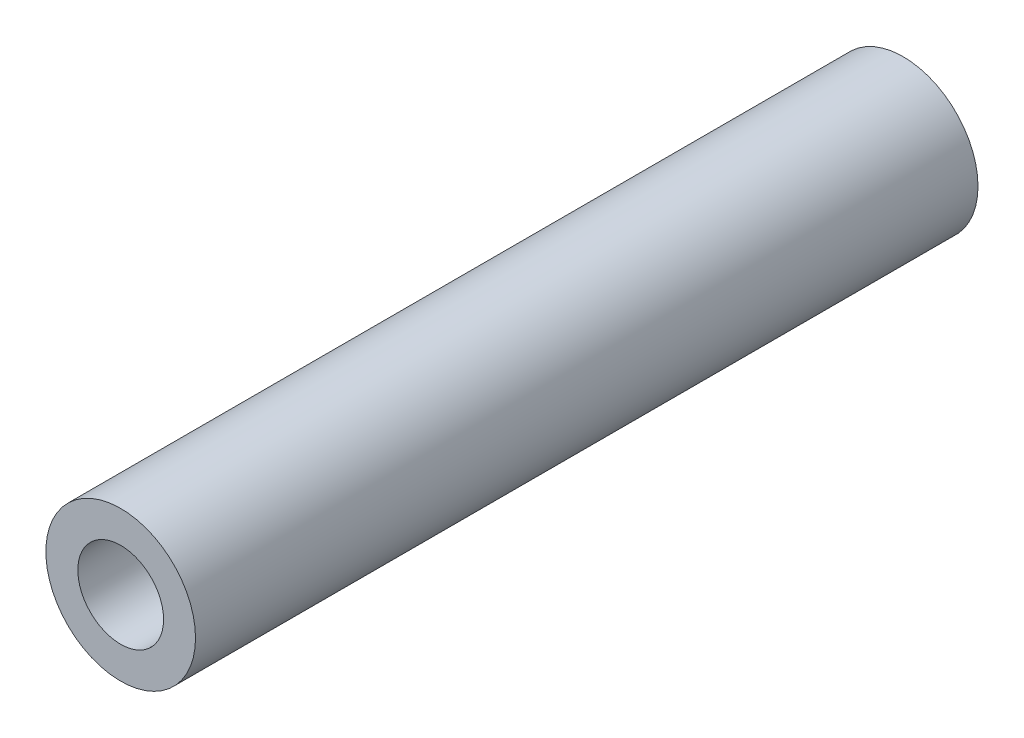
ISO-10303-21;
HEADER;
FILE_DESCRIPTION(('STEP AP214'),'2;1');
FILE_NAME('part.step','',(''),(''),'','','');
FILE_SCHEMA(('AUTOMOTIVE_DESIGN { 1 0 10303 214 1 1 1 1 }'));
ENDSEC;
DATA;
#1=APPLICATION_CONTEXT('core data for automotive mechanical design processes');
#2=APPLICATION_PROTOCOL_DEFINITION('international standard','automotive_design',2000,#1);
#3=PRODUCT_CONTEXT('',#1,'mechanical');
#4=PRODUCT('Part','Part','',(#3));
#5=PRODUCT_RELATED_PRODUCT_CATEGORY('part','',(#4));
#6=PRODUCT_DEFINITION_FORMATION('','',#4);
#7=PRODUCT_DEFINITION_CONTEXT('part definition',#1,'design');
#8=PRODUCT_DEFINITION('design','',#6,#7);
#9=PRODUCT_DEFINITION_SHAPE('','',#8);
#10=(LENGTH_UNIT() NAMED_UNIT(*) SI_UNIT(.MILLI.,.METRE.));
#11=(NAMED_UNIT(*) PLANE_ANGLE_UNIT() SI_UNIT($,.RADIAN.));
#12=(NAMED_UNIT(*) SI_UNIT($,.STERADIAN.) SOLID_ANGLE_UNIT());
#13=UNCERTAINTY_MEASURE_WITH_UNIT(LENGTH_MEASURE(1.E-05),#10,'distance_accuracy_value','');
#14=(GEOMETRIC_REPRESENTATION_CONTEXT(3) GLOBAL_UNCERTAINTY_ASSIGNED_CONTEXT((#13)) GLOBAL_UNIT_ASSIGNED_CONTEXT((#10,
#11,#12)) REPRESENTATION_CONTEXT('',''));
#15=CARTESIAN_POINT('',(0.,0.,0.));
#16=DIRECTION('',(0.,0.,1.));
#17=DIRECTION('',(1.,0.,0.));
#18=AXIS2_PLACEMENT_3D('',#15,#16,#17);
#19=CARTESIAN_POINT('',(0.,0.,25.49906));
#20=DIRECTION('',(0.,0.,1.));
#21=DIRECTION('',(1.,0.,0.));
#22=AXIS2_PLACEMENT_3D('',#19,#20,#21);
#23=PLANE('',#22);
#24=CARTESIAN_POINT('',(0.,0.,25.49906));
#25=DIRECTION('',(0.,0.,1.));
#26=DIRECTION('',(1.,0.,0.));
#27=AXIS2_PLACEMENT_3D('',#24,#25,#26);
#28=CIRCLE('',#27,2.4384);
#29=CARTESIAN_POINT('',(2.4384,0.,25.49906));
#30=VERTEX_POINT('',#29);
#31=EDGE_CURVE('E10',#30,#30,#28,.T.);
#32=ORIENTED_EDGE('',*,*,#31,.T.);
#33=EDGE_LOOP('',(#32));
#34=FACE_BOUND('',#33,.T.);
#35=CARTESIAN_POINT('',(0.,0.,25.49906));
#36=DIRECTION('',(0.,0.,1.));
#37=DIRECTION('',(1.,0.,0.));
#38=AXIS2_PLACEMENT_3D('',#35,#36,#37);
#39=CIRCLE('',#38,1.397);
#40=CARTESIAN_POINT('',(1.397,0.,25.49906));
#41=VERTEX_POINT('',#40);
#42=EDGE_CURVE('E44',#41,#41,#39,.T.);
#43=ORIENTED_EDGE('',*,*,#42,.F.);
#44=EDGE_LOOP('',(#43));
#45=FACE_BOUND('',#44,.T.);
#46=ADVANCED_FACE('F33',(#34,#45),#23,.T.);
#47=CARTESIAN_POINT('',(0.,0.,0.));
#48=DIRECTION('',(0.,0.,1.));
#49=DIRECTION('',(1.,0.,0.));
#50=AXIS2_PLACEMENT_3D('',#47,#48,#49);
#51=PLANE('',#50);
#52=CARTESIAN_POINT('',(0.,0.,0.));
#53=DIRECTION('',(0.,0.,1.));
#54=DIRECTION('',(1.,0.,0.));
#55=AXIS2_PLACEMENT_3D('',#52,#53,#54);
#56=CIRCLE('',#55,2.4384);
#57=CARTESIAN_POINT('',(2.4384,0.,0.));
#58=VERTEX_POINT('',#57);
#59=EDGE_CURVE('E37',#58,#58,#56,.T.);
#60=ORIENTED_EDGE('',*,*,#59,.F.);
#61=EDGE_LOOP('',(#60));
#62=FACE_BOUND('',#61,.T.);
#63=CARTESIAN_POINT('',(0.,0.,0.));
#64=DIRECTION('',(0.,0.,1.));
#65=DIRECTION('',(1.,0.,0.));
#66=AXIS2_PLACEMENT_3D('',#63,#64,#65);
#67=CIRCLE('',#66,1.397);
#68=CARTESIAN_POINT('',(1.397,0.,0.));
#69=VERTEX_POINT('',#68);
#70=EDGE_CURVE('E46',#69,#69,#67,.T.);
#71=ORIENTED_EDGE('',*,*,#70,.T.);
#72=EDGE_LOOP('',(#71));
#73=FACE_BOUND('',#72,.T.);
#74=ADVANCED_FACE('F56',(#62,#73),#51,.F.);
#75=CARTESIAN_POINT('',(0.,0.,25.49906));
#76=DIRECTION('',(0.,0.,-1.));
#77=DIRECTION('',(-1.,0.,0.));
#78=AXIS2_PLACEMENT_3D('',#75,#76,#77);
#79=CYLINDRICAL_SURFACE('',#78,2.4384);
#80=ORIENTED_EDGE('',*,*,#31,.F.);
#81=EDGE_LOOP('',(#80));
#82=FACE_BOUND('',#81,.T.);
#83=ORIENTED_EDGE('',*,*,#59,.T.);
#84=EDGE_LOOP('',(#83));
#85=FACE_BOUND('',#84,.T.);
#86=ADVANCED_FACE('F35',(#82,#85),#79,.T.);
#87=CARTESIAN_POINT('',(0.,0.,25.49906));
#88=DIRECTION('',(0.,0.,-1.));
#89=DIRECTION('',(-1.,0.,0.));
#90=AXIS2_PLACEMENT_3D('',#87,#88,#89);
#91=CYLINDRICAL_SURFACE('',#90,1.397);
#92=ORIENTED_EDGE('',*,*,#42,.T.);
#93=EDGE_LOOP('',(#92));
#94=FACE_BOUND('',#93,.T.);
#95=ORIENTED_EDGE('',*,*,#70,.F.);
#96=EDGE_LOOP('',(#95));
#97=FACE_BOUND('',#96,.T.);
#98=ADVANCED_FACE('F52',(#94,#97),#91,.F.);
#99=CLOSED_SHELL('',(#46,#74,#86,#98));
#100=MANIFOLD_SOLID_BREP('B2',#99);
#101=ADVANCED_BREP_SHAPE_REPRESENTATION('',(#18,#100),#14);
#102=SHAPE_DEFINITION_REPRESENTATION(#9,#101);
ENDSEC;
END-ISO-10303-21;
